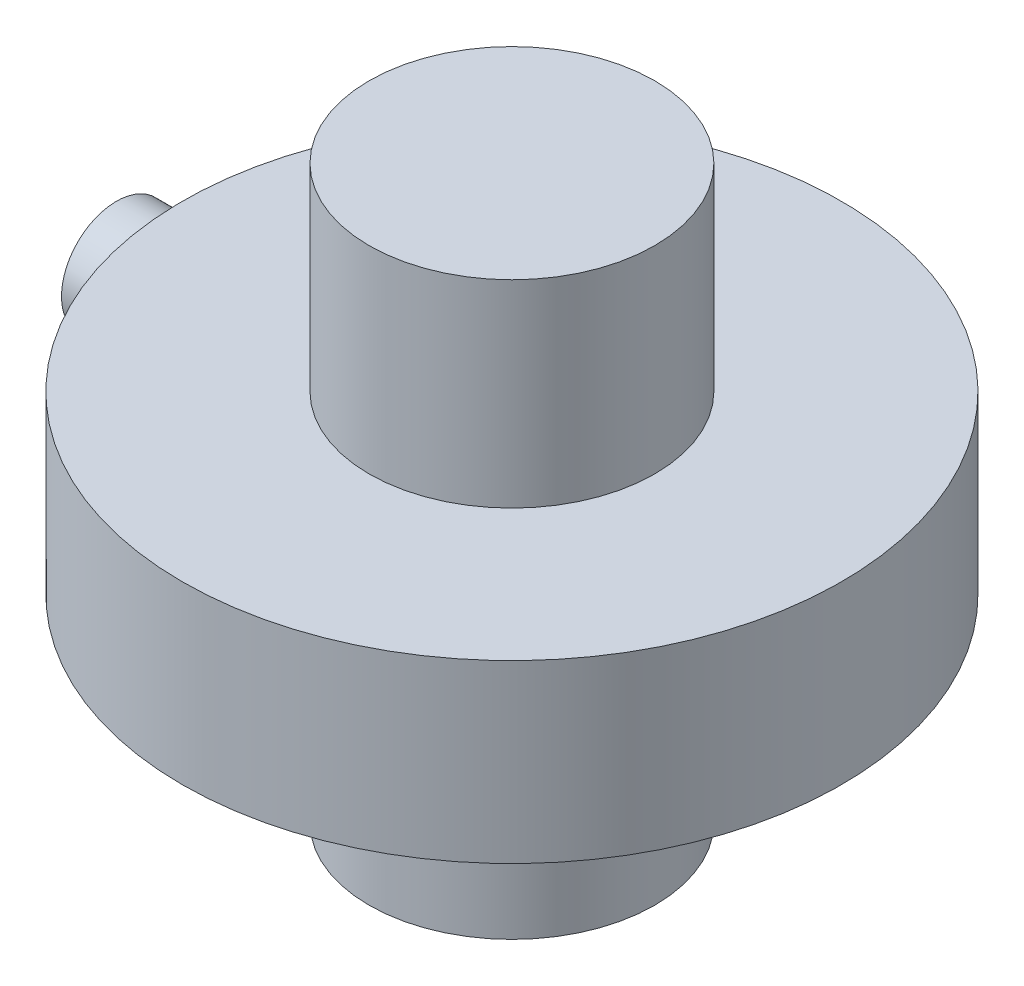
ISO-10303-21;
HEADER;
FILE_DESCRIPTION(('STEP AP214'),'2;1');
FILE_NAME('part.step','',(''),(''),'','','');
FILE_SCHEMA(('AUTOMOTIVE_DESIGN { 1 0 10303 214 1 1 1 1 }'));
ENDSEC;
DATA;
#1=APPLICATION_CONTEXT('core data for automotive mechanical design processes');
#2=APPLICATION_PROTOCOL_DEFINITION('international standard','automotive_design',2000,#1);
#3=PRODUCT_CONTEXT('',#1,'mechanical');
#4=PRODUCT('Part','Part','',(#3));
#5=PRODUCT_RELATED_PRODUCT_CATEGORY('part','',(#4));
#6=PRODUCT_DEFINITION_FORMATION('','',#4);
#7=PRODUCT_DEFINITION_CONTEXT('part definition',#1,'design');
#8=PRODUCT_DEFINITION('design','',#6,#7);
#9=PRODUCT_DEFINITION_SHAPE('','',#8);
#10=(LENGTH_UNIT() NAMED_UNIT(*) SI_UNIT(.MILLI.,.METRE.));
#11=(NAMED_UNIT(*) PLANE_ANGLE_UNIT() SI_UNIT($,.RADIAN.));
#12=(NAMED_UNIT(*) SI_UNIT($,.STERADIAN.) SOLID_ANGLE_UNIT());
#13=UNCERTAINTY_MEASURE_WITH_UNIT(LENGTH_MEASURE(1.E-05),#10,'distance_accuracy_value','');
#14=(GEOMETRIC_REPRESENTATION_CONTEXT(3) GLOBAL_UNCERTAINTY_ASSIGNED_CONTEXT((#13)) GLOBAL_UNIT_ASSIGNED_CONTEXT((#10,
#11,#12)) REPRESENTATION_CONTEXT('',''));
#15=CARTESIAN_POINT('',(0.,0.,0.));
#16=DIRECTION('',(0.,0.,1.));
#17=DIRECTION('',(1.,0.,0.));
#18=AXIS2_PLACEMENT_3D('',#15,#16,#17);
#19=CARTESIAN_POINT('',(36.,8.,0.));
#20=DIRECTION('',(0.,1.,0.));
#21=DIRECTION('',(0.,0.,1.));
#22=AXIS2_PLACEMENT_3D('',#19,#20,#21);
#23=PLANE('',#22);
#24=CARTESIAN_POINT('',(36.,8.,0.));
#25=DIRECTION('',(0.,1.,0.));
#26=DIRECTION('',(0.,0.,1.));
#27=AXIS2_PLACEMENT_3D('',#24,#25,#26);
#28=CIRCLE('',#27,30.);
#29=CARTESIAN_POINT('',(36.,8.,30.));
#30=VERTEX_POINT('',#29);
#31=EDGE_CURVE('E45',#30,#30,#28,.T.);
#32=ORIENTED_EDGE('',*,*,#31,.T.);
#33=EDGE_LOOP('',(#32));
#34=FACE_BOUND('',#33,.T.);
#35=CARTESIAN_POINT('',(36.,8.,0.));
#36=DIRECTION('',(0.,1.,0.));
#37=DIRECTION('',(0.,0.,1.));
#38=AXIS2_PLACEMENT_3D('',#35,#36,#37);
#39=CIRCLE('',#38,13.);
#40=CARTESIAN_POINT('',(36.,8.,13.));
#41=VERTEX_POINT('',#40);
#42=EDGE_CURVE('E54',#41,#41,#39,.F.);
#43=ORIENTED_EDGE('',*,*,#42,.T.);
#44=EDGE_LOOP('',(#43));
#45=FACE_BOUND('',#44,.T.);
#46=ADVANCED_FACE('F38',(#34,#45),#23,.T.);
#47=CARTESIAN_POINT('',(36.,-8.,0.));
#48=DIRECTION('',(0.,1.,0.));
#49=DIRECTION('',(0.,0.,1.));
#50=AXIS2_PLACEMENT_3D('',#47,#48,#49);
#51=PLANE('',#50);
#52=CARTESIAN_POINT('',(36.,-8.,0.));
#53=DIRECTION('',(0.,1.,0.));
#54=DIRECTION('',(0.,0.,1.));
#55=AXIS2_PLACEMENT_3D('',#52,#53,#54);
#56=CIRCLE('',#55,30.);
#57=CARTESIAN_POINT('',(36.,-8.,30.));
#58=VERTEX_POINT('',#57);
#59=EDGE_CURVE('E49',#58,#58,#56,.T.);
#60=ORIENTED_EDGE('',*,*,#59,.F.);
#61=EDGE_LOOP('',(#60));
#62=FACE_BOUND('',#61,.T.);
#63=CARTESIAN_POINT('',(36.,-8.,0.));
#64=DIRECTION('',(0.,1.,0.));
#65=DIRECTION('',(0.,0.,1.));
#66=AXIS2_PLACEMENT_3D('',#63,#64,#65);
#67=CIRCLE('',#66,13.);
#68=CARTESIAN_POINT('',(36.,-8.,13.));
#69=VERTEX_POINT('',#68);
#70=EDGE_CURVE('E11',#69,#69,#67,.F.);
#71=ORIENTED_EDGE('',*,*,#70,.F.);
#72=EDGE_LOOP('',(#71));
#73=FACE_BOUND('',#72,.T.);
#74=ADVANCED_FACE('F83',(#62,#73),#51,.F.);
#75=CARTESIAN_POINT('',(36.,8.,0.));
#76=DIRECTION('',(0.,-1.,0.));
#77=DIRECTION('',(0.,0.,-1.));
#78=AXIS2_PLACEMENT_3D('',#75,#76,#77);
#79=CYLINDRICAL_SURFACE('',#78,30.);
#80=ORIENTED_EDGE('',*,*,#31,.F.);
#81=EDGE_LOOP('',(#80));
#82=FACE_BOUND('',#81,.T.);
#83=ORIENTED_EDGE('',*,*,#59,.T.);
#84=EDGE_LOOP('',(#83));
#85=FACE_BOUND('',#84,.T.);
#86=ADVANCED_FACE('F40',(#82,#85),#79,.T.);
#87=CARTESIAN_POINT('',(36.,-26.,0.));
#88=DIRECTION('',(0.,1.,0.));
#89=DIRECTION('',(0.,0.,1.));
#90=AXIS2_PLACEMENT_3D('',#87,#88,#89);
#91=PLANE('',#90);
#92=CARTESIAN_POINT('',(36.,-26.,0.));
#93=DIRECTION('',(0.,1.,0.));
#94=DIRECTION('',(0.,0.,1.));
#95=AXIS2_PLACEMENT_3D('',#92,#93,#94);
#96=CIRCLE('',#95,13.);
#97=CARTESIAN_POINT('',(36.,-26.,13.));
#98=VERTEX_POINT('',#97);
#99=EDGE_CURVE('E59',#98,#98,#96,.T.);
#100=ORIENTED_EDGE('',*,*,#99,.F.);
#101=EDGE_LOOP('',(#100));
#102=FACE_BOUND('',#101,.T.);
#103=ADVANCED_FACE('F77',(#102),#91,.F.);
#104=CARTESIAN_POINT('',(36.,26.,0.));
#105=DIRECTION('',(0.,-1.,0.));
#106=DIRECTION('',(0.,0.,-1.));
#107=AXIS2_PLACEMENT_3D('',#104,#105,#106);
#108=CYLINDRICAL_SURFACE('',#107,13.);
#109=ORIENTED_EDGE('',*,*,#99,.T.);
#110=EDGE_LOOP('',(#109));
#111=FACE_BOUND('',#110,.T.);
#112=ORIENTED_EDGE('',*,*,#70,.T.);
#113=EDGE_LOOP('',(#112));
#114=FACE_BOUND('',#113,.T.);
#115=ADVANCED_FACE('F69',(#111,#114),#108,.T.);
#116=ORIENTED_EDGE('',*,*,#42,.F.);
#117=EDGE_LOOP('',(#116));
#118=FACE_BOUND('',#117,.T.);
#119=CARTESIAN_POINT('',(36.,26.,0.));
#120=DIRECTION('',(0.,1.,0.));
#121=DIRECTION('',(0.,0.,1.));
#122=AXIS2_PLACEMENT_3D('',#119,#120,#121);
#123=CIRCLE('',#122,13.);
#124=CARTESIAN_POINT('',(36.,26.,13.));
#125=VERTEX_POINT('',#124);
#126=EDGE_CURVE('E58',#125,#125,#123,.T.);
#127=ORIENTED_EDGE('',*,*,#126,.F.);
#128=EDGE_LOOP('',(#127));
#129=FACE_BOUND('',#128,.T.);
#130=ADVANCED_FACE('F67',(#118,#129),#108,.T.);
#131=CARTESIAN_POINT('',(36.,26.,0.));
#132=DIRECTION('',(0.,1.,0.));
#133=DIRECTION('',(0.,0.,1.));
#134=AXIS2_PLACEMENT_3D('',#131,#132,#133);
#135=PLANE('',#134);
#136=ORIENTED_EDGE('',*,*,#126,.T.);
#137=EDGE_LOOP('',(#136));
#138=FACE_BOUND('',#137,.T.);
#139=ADVANCED_FACE('F65',(#138),#135,.T.);
#140=CLOSED_SHELL('',(#46,#74,#86,#103,#115,#130,#139));
#141=MANIFOLD_SOLID_BREP('B2',#140);
#142=CARTESIAN_POINT('',(10.,0.,0.));
#143=DIRECTION('',(-1.,0.,0.));
#144=DIRECTION('',(0.,0.,1.));
#145=AXIS2_PLACEMENT_3D('',#142,#143,#144);
#146=CYLINDRICAL_SURFACE('',#145,5.);
#147=CARTESIAN_POINT('',(10.,0.,0.));
#148=DIRECTION('',(1.,0.,0.));
#149=DIRECTION('',(0.,0.,-1.));
#150=AXIS2_PLACEMENT_3D('',#147,#148,#149);
#151=CIRCLE('',#150,5.);
#152=CARTESIAN_POINT('',(10.,0.,-5.));
#153=VERTEX_POINT('',#152);
#154=EDGE_CURVE('E37',#153,#153,#151,.T.);
#155=ORIENTED_EDGE('',*,*,#154,.F.);
#156=EDGE_LOOP('',(#155));
#157=FACE_BOUND('',#156,.T.);
#158=CARTESIAN_POINT('',(0.,0.,0.));
#159=DIRECTION('',(1.,0.,0.));
#160=DIRECTION('',(0.,0.,-1.));
#161=AXIS2_PLACEMENT_3D('',#158,#159,#160);
#162=CIRCLE('',#161,5.);
#163=CARTESIAN_POINT('',(0.,0.,-5.));
#164=VERTEX_POINT('',#163);
#165=EDGE_CURVE('E140',#164,#164,#162,.T.);
#166=ORIENTED_EDGE('',*,*,#165,.T.);
#167=EDGE_LOOP('',(#166));
#168=FACE_BOUND('',#167,.T.);
#169=ADVANCED_FACE('F137',(#157,#168),#146,.T.);
#170=CARTESIAN_POINT('',(10.,0.,0.));
#171=DIRECTION('',(1.,0.,0.));
#172=DIRECTION('',(0.,0.,-1.));
#173=AXIS2_PLACEMENT_3D('',#170,#171,#172);
#174=PLANE('',#173);
#175=ORIENTED_EDGE('',*,*,#154,.T.);
#176=EDGE_LOOP('',(#175));
#177=FACE_BOUND('',#176,.T.);
#178=ADVANCED_FACE('F152',(#177),#174,.T.);
#179=CARTESIAN_POINT('',(0.,0.,0.));
#180=DIRECTION('',(1.,0.,0.));
#181=DIRECTION('',(0.,0.,-1.));
#182=AXIS2_PLACEMENT_3D('',#179,#180,#181);
#183=PLANE('',#182);
#184=ORIENTED_EDGE('',*,*,#165,.F.);
#185=EDGE_LOOP('',(#184));
#186=FACE_BOUND('',#185,.T.);
#187=ADVANCED_FACE('F150',(#186),#183,.F.);
#188=CLOSED_SHELL('',(#169,#178,#187));
#189=MANIFOLD_SOLID_BREP('B6',#188);
#190=ADVANCED_BREP_SHAPE_REPRESENTATION('',(#18,#141,#189),#14);
#191=SHAPE_DEFINITION_REPRESENTATION(#9,#190);
ENDSEC;
END-ISO-10303-21;
